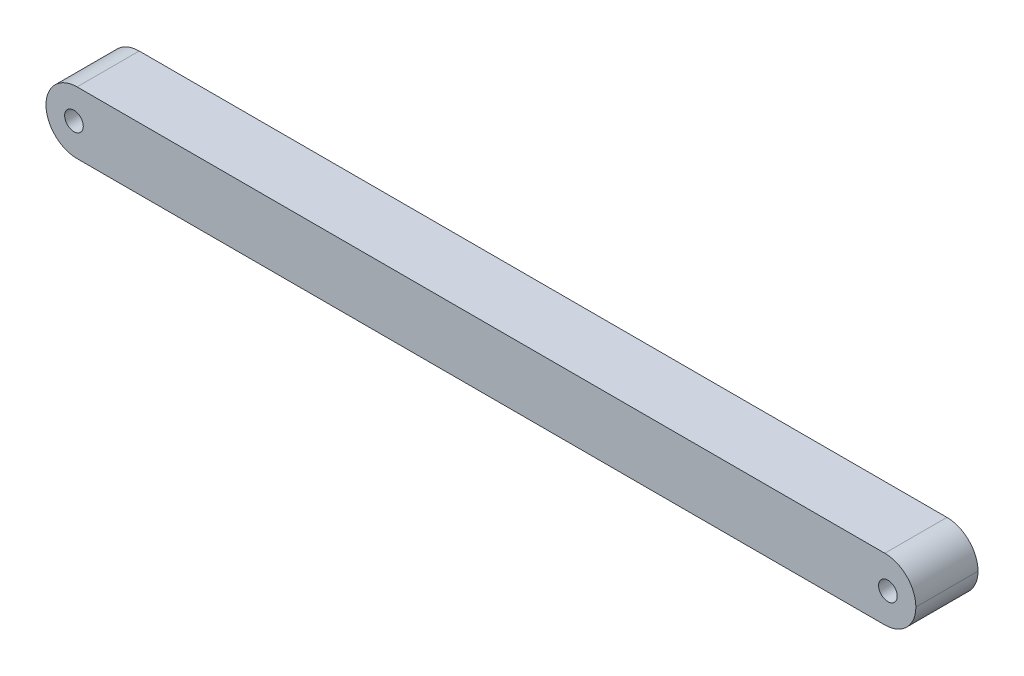
ISO-10303-21;
HEADER;
FILE_DESCRIPTION(('STEP AP214'),'2;1');
FILE_NAME('part.step','',(''),(''),'','','');
FILE_SCHEMA(('AUTOMOTIVE_DESIGN { 1 0 10303 214 1 1 1 1 }'));
ENDSEC;
DATA;
#1=APPLICATION_CONTEXT('core data for automotive mechanical design processes');
#2=APPLICATION_PROTOCOL_DEFINITION('international standard','automotive_design',2000,#1);
#3=PRODUCT_CONTEXT('',#1,'mechanical');
#4=PRODUCT('Part','Part','',(#3));
#5=PRODUCT_RELATED_PRODUCT_CATEGORY('part','',(#4));
#6=PRODUCT_DEFINITION_FORMATION('','',#4);
#7=PRODUCT_DEFINITION_CONTEXT('part definition',#1,'design');
#8=PRODUCT_DEFINITION('design','',#6,#7);
#9=PRODUCT_DEFINITION_SHAPE('','',#8);
#10=(LENGTH_UNIT() NAMED_UNIT(*) SI_UNIT(.MILLI.,.METRE.));
#11=(NAMED_UNIT(*) PLANE_ANGLE_UNIT() SI_UNIT($,.RADIAN.));
#12=(NAMED_UNIT(*) SI_UNIT($,.STERADIAN.) SOLID_ANGLE_UNIT());
#13=UNCERTAINTY_MEASURE_WITH_UNIT(LENGTH_MEASURE(1.E-05),#10,'distance_accuracy_value','');
#14=(GEOMETRIC_REPRESENTATION_CONTEXT(3) GLOBAL_UNCERTAINTY_ASSIGNED_CONTEXT((#13)) GLOBAL_UNIT_ASSIGNED_CONTEXT((#10,
#11,#12)) REPRESENTATION_CONTEXT('',''));
#15=CARTESIAN_POINT('',(0.,0.,0.));
#16=DIRECTION('',(0.,0.,1.));
#17=DIRECTION('',(1.,0.,0.));
#18=AXIS2_PLACEMENT_3D('',#15,#16,#17);
#19=CARTESIAN_POINT('',(135.,5.,10.));
#20=DIRECTION('',(0.,0.,1.));
#21=DIRECTION('',(1.,0.,0.));
#22=AXIS2_PLACEMENT_3D('',#19,#20,#21);
#23=CYLINDRICAL_SURFACE('',#22,5.);
#24=DIRECTION('',(0.,0.,1.));
#25=VECTOR('',#24,1.);
#26=CARTESIAN_POINT('',(135.,0.,10.));
#27=LINE('',#26,#25);
#28=CARTESIAN_POINT('',(135.,0.,0.));
#29=VERTEX_POINT('',#28);
#30=CARTESIAN_POINT('',(135.,0.,10.));
#31=VERTEX_POINT('',#30);
#32=EDGE_CURVE('E163',#29,#31,#27,.T.);
#33=ORIENTED_EDGE('',*,*,#32,.F.);
#34=CARTESIAN_POINT('',(135.,5.,0.));
#35=DIRECTION('',(0.,0.,1.));
#36=DIRECTION('',(1.,0.,0.));
#37=AXIS2_PLACEMENT_3D('',#34,#35,#36);
#38=CIRCLE('',#37,5.);
#39=CARTESIAN_POINT('',(140.,5.,0.));
#40=VERTEX_POINT('',#39);
#41=EDGE_CURVE('E55',#40,#29,#38,.F.);
#42=ORIENTED_EDGE('',*,*,#41,.F.);
#43=DIRECTION('',(0.,0.,-1.));
#44=VECTOR('',#43,1.);
#45=CARTESIAN_POINT('',(140.,5.,10.));
#46=LINE('',#45,#44);
#47=CARTESIAN_POINT('',(140.,5.,10.));
#48=VERTEX_POINT('',#47);
#49=EDGE_CURVE('E154',#40,#48,#46,.F.);
#50=ORIENTED_EDGE('',*,*,#49,.T.);
#51=CARTESIAN_POINT('',(135.,5.,10.));
#52=DIRECTION('',(0.,0.,1.));
#53=DIRECTION('',(1.,0.,0.));
#54=AXIS2_PLACEMENT_3D('',#51,#52,#53);
#55=CIRCLE('',#54,5.);
#56=EDGE_CURVE('E11',#31,#48,#55,.T.);
#57=ORIENTED_EDGE('',*,*,#56,.F.);
#58=EDGE_LOOP('',(#33,#42,#50,#57));
#59=FACE_BOUND('',#58,.T.);
#60=ADVANCED_FACE('F47',(#59),#23,.T.);
#61=CARTESIAN_POINT('',(135.,5.,10.));
#62=DIRECTION('',(0.,0.,1.));
#63=DIRECTION('',(1.,0.,0.));
#64=AXIS2_PLACEMENT_3D('',#61,#62,#63);
#65=CYLINDRICAL_SURFACE('',#64,5.);
#66=DIRECTION('',(0.,0.,-1.));
#67=VECTOR('',#66,1.);
#68=CARTESIAN_POINT('',(135.,10.,10.));
#69=LINE('',#68,#67);
#70=CARTESIAN_POINT('',(135.,10.,10.));
#71=VERTEX_POINT('',#70);
#72=CARTESIAN_POINT('',(135.,10.,0.));
#73=VERTEX_POINT('',#72);
#74=EDGE_CURVE('E124',#71,#73,#69,.T.);
#75=ORIENTED_EDGE('',*,*,#74,.F.);
#76=CARTESIAN_POINT('',(135.,5.,10.));
#77=DIRECTION('',(0.,0.,1.));
#78=DIRECTION('',(1.,0.,0.));
#79=AXIS2_PLACEMENT_3D('',#76,#77,#78);
#80=CIRCLE('',#79,5.);
#81=EDGE_CURVE('E157',#48,#71,#80,.T.);
#82=ORIENTED_EDGE('',*,*,#81,.F.);
#83=ORIENTED_EDGE('',*,*,#49,.F.);
#84=CARTESIAN_POINT('',(135.,5.,0.));
#85=DIRECTION('',(0.,0.,1.));
#86=DIRECTION('',(1.,0.,0.));
#87=AXIS2_PLACEMENT_3D('',#84,#85,#86);
#88=CIRCLE('',#87,5.);
#89=EDGE_CURVE('E160',#73,#40,#88,.F.);
#90=ORIENTED_EDGE('',*,*,#89,.F.);
#91=EDGE_LOOP('',(#75,#82,#83,#90));
#92=FACE_BOUND('',#91,.T.);
#93=ADVANCED_FACE('F202',(#92),#65,.T.);
#94=CARTESIAN_POINT('',(5.,5.,10.));
#95=DIRECTION('',(0.,0.,-1.));
#96=DIRECTION('',(-1.,0.,0.));
#97=AXIS2_PLACEMENT_3D('',#94,#95,#96);
#98=CYLINDRICAL_SURFACE('',#97,5.);
#99=DIRECTION('',(0.,0.,1.));
#100=VECTOR('',#99,1.);
#101=CARTESIAN_POINT('',(0.,5.,10.));
#102=LINE('',#101,#100);
#103=CARTESIAN_POINT('',(0.,5.,10.));
#104=VERTEX_POINT('',#103);
#105=CARTESIAN_POINT('',(0.,5.,0.));
#106=VERTEX_POINT('',#105);
#107=EDGE_CURVE('E109',#104,#106,#102,.F.);
#108=ORIENTED_EDGE('',*,*,#107,.T.);
#109=CARTESIAN_POINT('',(5.,5.,0.));
#110=DIRECTION('',(0.,0.,1.));
#111=DIRECTION('',(1.,0.,0.));
#112=AXIS2_PLACEMENT_3D('',#109,#110,#111);
#113=CIRCLE('',#112,5.);
#114=CARTESIAN_POINT('',(5.,0.,0.));
#115=VERTEX_POINT('',#114);
#116=EDGE_CURVE('E103',#115,#106,#113,.F.);
#117=ORIENTED_EDGE('',*,*,#116,.F.);
#118=DIRECTION('',(0.,0.,1.));
#119=VECTOR('',#118,1.);
#120=CARTESIAN_POINT('',(5.,0.,10.));
#121=LINE('',#120,#119);
#122=CARTESIAN_POINT('',(5.,0.,10.));
#123=VERTEX_POINT('',#122);
#124=EDGE_CURVE('E143',#123,#115,#121,.F.);
#125=ORIENTED_EDGE('',*,*,#124,.F.);
#126=CARTESIAN_POINT('',(5.,5.,10.));
#127=DIRECTION('',(0.,0.,1.));
#128=DIRECTION('',(1.,0.,0.));
#129=AXIS2_PLACEMENT_3D('',#126,#127,#128);
#130=CIRCLE('',#129,5.);
#131=EDGE_CURVE('E149',#104,#123,#130,.T.);
#132=ORIENTED_EDGE('',*,*,#131,.F.);
#133=EDGE_LOOP('',(#108,#117,#125,#132));
#134=FACE_BOUND('',#133,.T.);
#135=ADVANCED_FACE('F206',(#134),#98,.T.);
#136=CARTESIAN_POINT('',(5.,5.,10.));
#137=DIRECTION('',(0.,0.,1.));
#138=DIRECTION('',(1.,0.,0.));
#139=AXIS2_PLACEMENT_3D('',#136,#137,#138);
#140=CYLINDRICAL_SURFACE('',#139,5.);
#141=DIRECTION('',(0.,0.,1.));
#142=VECTOR('',#141,1.);
#143=CARTESIAN_POINT('',(5.,10.,10.));
#144=LINE('',#143,#142);
#145=CARTESIAN_POINT('',(5.,10.,0.));
#146=VERTEX_POINT('',#145);
#147=CARTESIAN_POINT('',(5.,10.,10.));
#148=VERTEX_POINT('',#147);
#149=EDGE_CURVE('E112',#146,#148,#144,.T.);
#150=ORIENTED_EDGE('',*,*,#149,.F.);
#151=CARTESIAN_POINT('',(5.,5.,0.));
#152=DIRECTION('',(0.,0.,1.));
#153=DIRECTION('',(1.,0.,0.));
#154=AXIS2_PLACEMENT_3D('',#151,#152,#153);
#155=CIRCLE('',#154,5.);
#156=EDGE_CURVE('E97',#106,#146,#155,.F.);
#157=ORIENTED_EDGE('',*,*,#156,.F.);
#158=ORIENTED_EDGE('',*,*,#107,.F.);
#159=CARTESIAN_POINT('',(5.,5.,10.));
#160=DIRECTION('',(0.,0.,1.));
#161=DIRECTION('',(1.,0.,0.));
#162=AXIS2_PLACEMENT_3D('',#159,#160,#161);
#163=CIRCLE('',#162,5.);
#164=EDGE_CURVE('E108',#148,#104,#163,.T.);
#165=ORIENTED_EDGE('',*,*,#164,.F.);
#166=EDGE_LOOP('',(#150,#157,#158,#165));
#167=FACE_BOUND('',#166,.T.);
#168=ADVANCED_FACE('F113',(#167),#140,.T.);
#169=CARTESIAN_POINT('',(0.,0.,10.));
#170=DIRECTION('',(0.,1.,0.));
#171=DIRECTION('',(0.,0.,1.));
#172=AXIS2_PLACEMENT_3D('',#169,#170,#171);
#173=PLANE('',#172);
#174=DIRECTION('',(1.,0.,0.));
#175=VECTOR('',#174,1.);
#176=CARTESIAN_POINT('',(0.,0.,0.));
#177=LINE('',#176,#175);
#178=EDGE_CURVE('E127',#115,#29,#177,.T.);
#179=ORIENTED_EDGE('',*,*,#178,.T.);
#180=ORIENTED_EDGE('',*,*,#32,.T.);
#181=DIRECTION('',(1.,0.,0.));
#182=VECTOR('',#181,1.);
#183=CARTESIAN_POINT('',(0.,0.,10.));
#184=LINE('',#183,#182);
#185=EDGE_CURVE('E172',#123,#31,#184,.T.);
#186=ORIENTED_EDGE('',*,*,#185,.F.);
#187=ORIENTED_EDGE('',*,*,#124,.T.);
#188=EDGE_LOOP('',(#179,#180,#186,#187));
#189=FACE_BOUND('',#188,.T.);
#190=ADVANCED_FACE('F197',(#189),#173,.F.);
#191=CARTESIAN_POINT('',(0.,10.,10.));
#192=DIRECTION('',(0.,1.,0.));
#193=DIRECTION('',(0.,0.,1.));
#194=AXIS2_PLACEMENT_3D('',#191,#192,#193);
#195=PLANE('',#194);
#196=DIRECTION('',(1.,0.,0.));
#197=VECTOR('',#196,1.);
#198=CARTESIAN_POINT('',(0.,10.,10.));
#199=LINE('',#198,#197);
#200=EDGE_CURVE('E169',#148,#71,#199,.T.);
#201=ORIENTED_EDGE('',*,*,#200,.T.);
#202=ORIENTED_EDGE('',*,*,#74,.T.);
#203=DIRECTION('',(1.,0.,0.));
#204=VECTOR('',#203,1.);
#205=CARTESIAN_POINT('',(0.,10.,0.));
#206=LINE('',#205,#204);
#207=EDGE_CURVE('E102',#146,#73,#206,.T.);
#208=ORIENTED_EDGE('',*,*,#207,.F.);
#209=ORIENTED_EDGE('',*,*,#149,.T.);
#210=EDGE_LOOP('',(#201,#202,#208,#209));
#211=FACE_BOUND('',#210,.T.);
#212=ADVANCED_FACE('F122',(#211),#195,.T.);
#213=CARTESIAN_POINT('',(135.5,5.,10.));
#214=DIRECTION('',(0.,0.,-1.));
#215=DIRECTION('',(-1.,0.,0.));
#216=AXIS2_PLACEMENT_3D('',#213,#214,#215);
#217=CYLINDRICAL_SURFACE('',#216,1.5);
#218=CARTESIAN_POINT('',(135.5,5.,10.));
#219=DIRECTION('',(0.,0.,1.));
#220=DIRECTION('',(1.,0.,0.));
#221=AXIS2_PLACEMENT_3D('',#218,#219,#220);
#222=CIRCLE('',#221,1.5);
#223=CARTESIAN_POINT('',(137.,5.,10.));
#224=VERTEX_POINT('',#223);
#225=EDGE_CURVE('E132',#224,#224,#222,.T.);
#226=ORIENTED_EDGE('',*,*,#225,.T.);
#227=EDGE_LOOP('',(#226));
#228=FACE_BOUND('',#227,.T.);
#229=CARTESIAN_POINT('',(135.5,5.,0.));
#230=DIRECTION('',(0.,0.,1.));
#231=DIRECTION('',(1.,0.,0.));
#232=AXIS2_PLACEMENT_3D('',#229,#230,#231);
#233=CIRCLE('',#232,1.5);
#234=CARTESIAN_POINT('',(137.,5.,0.));
#235=VERTEX_POINT('',#234);
#236=EDGE_CURVE('E135',#235,#235,#233,.T.);
#237=ORIENTED_EDGE('',*,*,#236,.F.);
#238=EDGE_LOOP('',(#237));
#239=FACE_BOUND('',#238,.T.);
#240=ADVANCED_FACE('F186',(#228,#239),#217,.F.);
#241=CARTESIAN_POINT('',(4.5,5.,10.));
#242=DIRECTION('',(0.,0.,-1.));
#243=DIRECTION('',(-1.,0.,0.));
#244=AXIS2_PLACEMENT_3D('',#241,#242,#243);
#245=CYLINDRICAL_SURFACE('',#244,1.5);
#246=CARTESIAN_POINT('',(4.5,5.,10.));
#247=DIRECTION('',(0.,0.,1.));
#248=DIRECTION('',(1.,0.,0.));
#249=AXIS2_PLACEMENT_3D('',#246,#247,#248);
#250=CIRCLE('',#249,1.5);
#251=CARTESIAN_POINT('',(6.,5.,10.));
#252=VERTEX_POINT('',#251);
#253=EDGE_CURVE('E119',#252,#252,#250,.T.);
#254=ORIENTED_EDGE('',*,*,#253,.T.);
#255=EDGE_LOOP('',(#254));
#256=FACE_BOUND('',#255,.T.);
#257=CARTESIAN_POINT('',(4.5,5.,0.));
#258=DIRECTION('',(0.,0.,1.));
#259=DIRECTION('',(1.,0.,0.));
#260=AXIS2_PLACEMENT_3D('',#257,#258,#259);
#261=CIRCLE('',#260,1.5);
#262=CARTESIAN_POINT('',(6.,5.,0.));
#263=VERTEX_POINT('',#262);
#264=EDGE_CURVE('E126',#263,#263,#261,.T.);
#265=ORIENTED_EDGE('',*,*,#264,.F.);
#266=EDGE_LOOP('',(#265));
#267=FACE_BOUND('',#266,.T.);
#268=ADVANCED_FACE('F188',(#256,#267),#245,.F.);
#269=CARTESIAN_POINT('',(0.,0.,10.));
#270=DIRECTION('',(0.,0.,1.));
#271=DIRECTION('',(1.,0.,0.));
#272=AXIS2_PLACEMENT_3D('',#269,#270,#271);
#273=PLANE('',#272);
#274=ORIENTED_EDGE('',*,*,#225,.F.);
#275=EDGE_LOOP('',(#274));
#276=FACE_BOUND('',#275,.T.);
#277=ORIENTED_EDGE('',*,*,#185,.T.);
#278=ORIENTED_EDGE('',*,*,#56,.T.);
#279=ORIENTED_EDGE('',*,*,#81,.T.);
#280=ORIENTED_EDGE('',*,*,#200,.F.);
#281=ORIENTED_EDGE('',*,*,#164,.T.);
#282=ORIENTED_EDGE('',*,*,#131,.T.);
#283=EDGE_LOOP('',(#277,#278,#279,#280,#281,#282));
#284=FACE_BOUND('',#283,.T.);
#285=ORIENTED_EDGE('',*,*,#253,.F.);
#286=EDGE_LOOP('',(#285));
#287=FACE_BOUND('',#286,.T.);
#288=ADVANCED_FACE('F194',(#276,#284,#287),#273,.T.);
#289=CARTESIAN_POINT('',(0.,0.,0.));
#290=DIRECTION('',(0.,0.,1.));
#291=DIRECTION('',(1.,0.,0.));
#292=AXIS2_PLACEMENT_3D('',#289,#290,#291);
#293=PLANE('',#292);
#294=ORIENTED_EDGE('',*,*,#236,.T.);
#295=EDGE_LOOP('',(#294));
#296=FACE_BOUND('',#295,.T.);
#297=ORIENTED_EDGE('',*,*,#89,.T.);
#298=ORIENTED_EDGE('',*,*,#41,.T.);
#299=ORIENTED_EDGE('',*,*,#178,.F.);
#300=ORIENTED_EDGE('',*,*,#116,.T.);
#301=ORIENTED_EDGE('',*,*,#156,.T.);
#302=ORIENTED_EDGE('',*,*,#207,.T.);
#303=EDGE_LOOP('',(#297,#298,#299,#300,#301,#302));
#304=FACE_BOUND('',#303,.T.);
#305=ORIENTED_EDGE('',*,*,#264,.T.);
#306=EDGE_LOOP('',(#305));
#307=FACE_BOUND('',#306,.T.);
#308=ADVANCED_FACE('F99',(#296,#304,#307),#293,.F.);
#309=CLOSED_SHELL('',(#60,#93,#135,#168,#190,#212,#240,#268,#288,#308));
#310=MANIFOLD_SOLID_BREP('B2',#309);
#311=ADVANCED_BREP_SHAPE_REPRESENTATION('',(#18,#310),#14);
#312=SHAPE_DEFINITION_REPRESENTATION(#9,#311);
ENDSEC;
END-ISO-10303-21;
